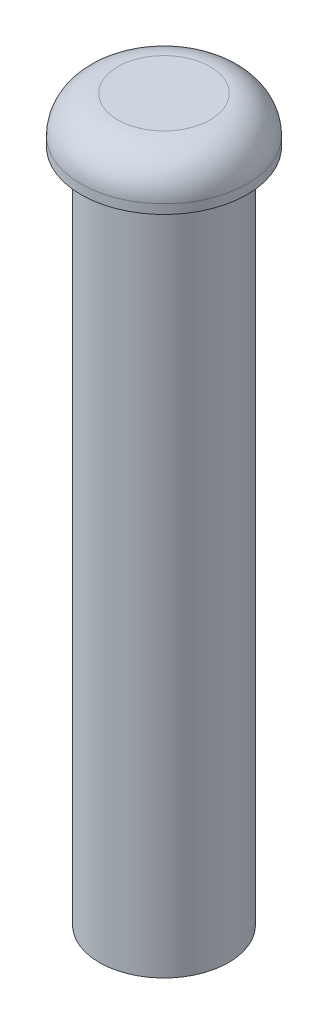
ISO-10303-21;
HEADER;
FILE_DESCRIPTION(('STEP AP214'),'2;1');
FILE_NAME('part.step','',(''),(''),'','','');
FILE_SCHEMA(('AUTOMOTIVE_DESIGN { 1 0 10303 214 1 1 1 1 }'));
ENDSEC;
DATA;
#1=APPLICATION_CONTEXT('core data for automotive mechanical design processes');
#2=APPLICATION_PROTOCOL_DEFINITION('international standard','automotive_design',2000,#1);
#3=PRODUCT_CONTEXT('',#1,'mechanical');
#4=PRODUCT('Part','Part','',(#3));
#5=PRODUCT_RELATED_PRODUCT_CATEGORY('part','',(#4));
#6=PRODUCT_DEFINITION_FORMATION('','',#4);
#7=PRODUCT_DEFINITION_CONTEXT('part definition',#1,'design');
#8=PRODUCT_DEFINITION('design','',#6,#7);
#9=PRODUCT_DEFINITION_SHAPE('','',#8);
#10=(LENGTH_UNIT() NAMED_UNIT(*) SI_UNIT(.MILLI.,.METRE.));
#11=(NAMED_UNIT(*) PLANE_ANGLE_UNIT() SI_UNIT($,.RADIAN.));
#12=(NAMED_UNIT(*) SI_UNIT($,.STERADIAN.) SOLID_ANGLE_UNIT());
#13=UNCERTAINTY_MEASURE_WITH_UNIT(LENGTH_MEASURE(1.E-05),#10,'distance_accuracy_value','');
#14=(GEOMETRIC_REPRESENTATION_CONTEXT(3) GLOBAL_UNCERTAINTY_ASSIGNED_CONTEXT((#13)) GLOBAL_UNIT_ASSIGNED_CONTEXT((#10,
#11,#12)) REPRESENTATION_CONTEXT('',''));
#15=CARTESIAN_POINT('',(0.,0.,0.));
#16=DIRECTION('',(0.,0.,1.));
#17=DIRECTION('',(1.,0.,0.));
#18=AXIS2_PLACEMENT_3D('',#15,#16,#17);
#19=CARTESIAN_POINT('',(0.,73.,0.));
#20=DIRECTION('',(0.,-1.,0.));
#21=DIRECTION('',(0.,0.,-1.));
#22=AXIS2_PLACEMENT_3D('',#19,#20,#21);
#23=CYLINDRICAL_SURFACE('',#22,7.);
#24=CARTESIAN_POINT('',(0.,73.,0.));
#25=DIRECTION('',(0.,1.,0.));
#26=DIRECTION('',(0.,0.,1.));
#27=AXIS2_PLACEMENT_3D('',#24,#25,#26);
#28=CIRCLE('',#27,7.);
#29=CARTESIAN_POINT('',(0.,73.,7.));
#30=VERTEX_POINT('',#29);
#31=EDGE_CURVE('E56',#30,#30,#28,.T.);
#32=ORIENTED_EDGE('',*,*,#31,.F.);
#33=EDGE_LOOP('',(#32));
#34=FACE_BOUND('',#33,.T.);
#35=CARTESIAN_POINT('',(0.,0.,0.));
#36=DIRECTION('',(0.,1.,0.));
#37=DIRECTION('',(0.,0.,1.));
#38=AXIS2_PLACEMENT_3D('',#35,#36,#37);
#39=CIRCLE('',#38,7.);
#40=CARTESIAN_POINT('',(0.,0.,7.));
#41=VERTEX_POINT('',#40);
#42=EDGE_CURVE('E61',#41,#41,#39,.T.);
#43=ORIENTED_EDGE('',*,*,#42,.T.);
#44=EDGE_LOOP('',(#43));
#45=FACE_BOUND('',#44,.T.);
#46=ADVANCED_FACE('F43',(#34,#45),#23,.T.);
#47=CARTESIAN_POINT('',(0.,0.,0.));
#48=DIRECTION('',(0.,1.,0.));
#49=DIRECTION('',(0.,0.,1.));
#50=AXIS2_PLACEMENT_3D('',#47,#48,#49);
#51=PLANE('',#50);
#52=ORIENTED_EDGE('',*,*,#42,.F.);
#53=EDGE_LOOP('',(#52));
#54=FACE_BOUND('',#53,.T.);
#55=ADVANCED_FACE('F89',(#54),#51,.F.);
#56=CARTESIAN_POINT('',(0.,78.,0.));
#57=DIRECTION('',(0.,-1.,0.));
#58=DIRECTION('',(0.,0.,-1.));
#59=AXIS2_PLACEMENT_3D('',#56,#57,#58);
#60=CYLINDRICAL_SURFACE('',#59,9.);
#61=CARTESIAN_POINT('',(0.,74.,0.));
#62=DIRECTION('',(0.,1.,0.));
#63=DIRECTION('',(0.,0.,1.));
#64=AXIS2_PLACEMENT_3D('',#61,#62,#63);
#65=CIRCLE('',#64,9.);
#66=CARTESIAN_POINT('',(0.,74.,9.));
#67=VERTEX_POINT('',#66);
#68=EDGE_CURVE('E10',#67,#67,#65,.F.);
#69=ORIENTED_EDGE('',*,*,#68,.T.);
#70=EDGE_LOOP('',(#69));
#71=FACE_BOUND('',#70,.T.);
#72=CARTESIAN_POINT('',(0.,73.,0.));
#73=DIRECTION('',(0.,1.,0.));
#74=DIRECTION('',(0.,0.,1.));
#75=AXIS2_PLACEMENT_3D('',#72,#73,#74);
#76=CIRCLE('',#75,9.);
#77=CARTESIAN_POINT('',(0.,73.,9.));
#78=VERTEX_POINT('',#77);
#79=EDGE_CURVE('E66',#78,#78,#76,.T.);
#80=ORIENTED_EDGE('',*,*,#79,.T.);
#81=EDGE_LOOP('',(#80));
#82=FACE_BOUND('',#81,.T.);
#83=ADVANCED_FACE('F72',(#71,#82),#60,.T.);
#84=CARTESIAN_POINT('',(0.,78.,0.));
#85=DIRECTION('',(0.,1.,0.));
#86=DIRECTION('',(0.,0.,1.));
#87=AXIS2_PLACEMENT_3D('',#84,#85,#86);
#88=PLANE('',#87);
#89=CARTESIAN_POINT('',(0.,78.,0.));
#90=DIRECTION('',(0.,1.,0.));
#91=DIRECTION('',(0.,0.,1.));
#92=AXIS2_PLACEMENT_3D('',#89,#90,#91);
#93=CIRCLE('',#92,5.);
#94=CARTESIAN_POINT('',(0.,78.,5.));
#95=VERTEX_POINT('',#94);
#96=EDGE_CURVE('E51',#95,#95,#93,.T.);
#97=ORIENTED_EDGE('',*,*,#96,.T.);
#98=EDGE_LOOP('',(#97));
#99=FACE_BOUND('',#98,.T.);
#100=ADVANCED_FACE('F76',(#99),#88,.T.);
#101=CARTESIAN_POINT('',(0.,73.,0.));
#102=DIRECTION('',(0.,1.,0.));
#103=DIRECTION('',(0.,0.,1.));
#104=AXIS2_PLACEMENT_3D('',#101,#102,#103);
#105=PLANE('',#104);
#106=ORIENTED_EDGE('',*,*,#31,.T.);
#107=EDGE_LOOP('',(#106));
#108=FACE_BOUND('',#107,.T.);
#109=ORIENTED_EDGE('',*,*,#79,.F.);
#110=EDGE_LOOP('',(#109));
#111=FACE_BOUND('',#110,.T.);
#112=ADVANCED_FACE('F74',(#108,#111),#105,.F.);
#113=CARTESIAN_POINT('',(0.,74.,0.));
#114=DIRECTION('',(0.,1.,0.));
#115=DIRECTION('',(0.,0.,1.));
#116=AXIS2_PLACEMENT_3D('',#113,#114,#115);
#117=TOROIDAL_SURFACE('',#116,5.,4.);
#118=ORIENTED_EDGE('',*,*,#68,.F.);
#119=EDGE_LOOP('',(#118));
#120=FACE_BOUND('',#119,.T.);
#121=ORIENTED_EDGE('',*,*,#96,.F.);
#122=EDGE_LOOP('',(#121));
#123=FACE_BOUND('',#122,.T.);
#124=ADVANCED_FACE('F45',(#120,#123),#117,.T.);
#125=CLOSED_SHELL('',(#46,#55,#83,#100,#112,#124));
#126=MANIFOLD_SOLID_BREP('B2',#125);
#127=ADVANCED_BREP_SHAPE_REPRESENTATION('',(#18,#126),#14);
#128=SHAPE_DEFINITION_REPRESENTATION(#9,#127);
ENDSEC;
END-ISO-10303-21;
